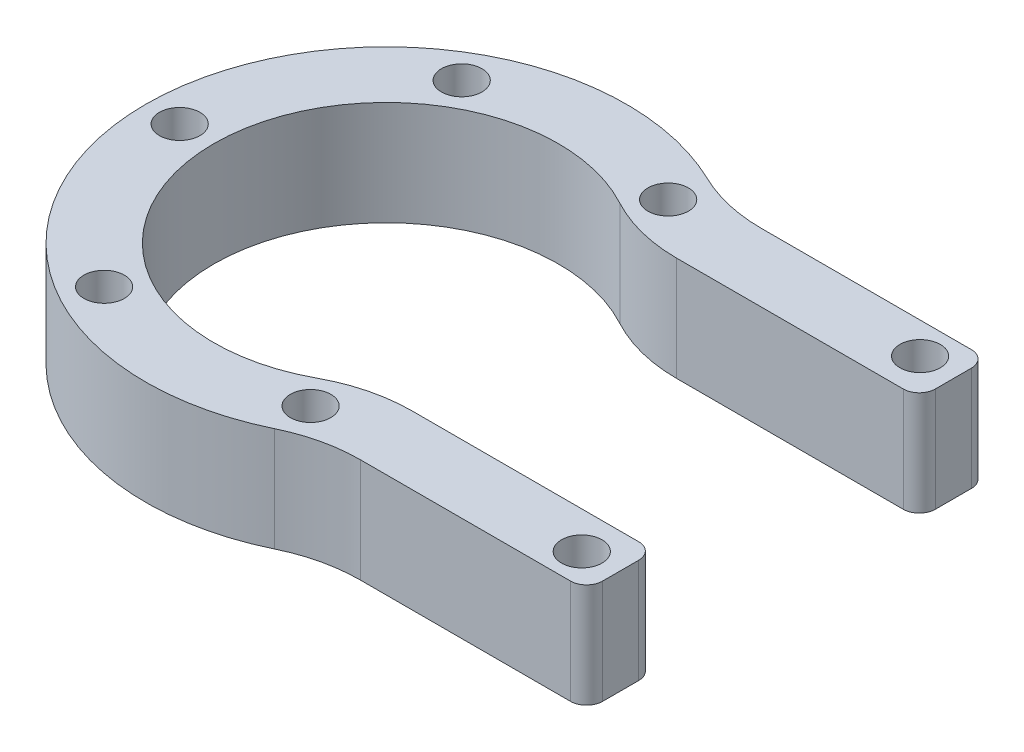
ISO-10303-21;
HEADER;
FILE_DESCRIPTION(('STEP AP214'),'2;1');
FILE_NAME('part.step','',(''),(''),'','','');
FILE_SCHEMA(('AUTOMOTIVE_DESIGN { 1 0 10303 214 1 1 1 1 }'));
ENDSEC;
DATA;
#1=APPLICATION_CONTEXT('core data for automotive mechanical design processes');
#2=APPLICATION_PROTOCOL_DEFINITION('international standard','automotive_design',2000,#1);
#3=PRODUCT_CONTEXT('',#1,'mechanical');
#4=PRODUCT('Part','Part','',(#3));
#5=PRODUCT_RELATED_PRODUCT_CATEGORY('part','',(#4));
#6=PRODUCT_DEFINITION_FORMATION('','',#4);
#7=PRODUCT_DEFINITION_CONTEXT('part definition',#1,'design');
#8=PRODUCT_DEFINITION('design','',#6,#7);
#9=PRODUCT_DEFINITION_SHAPE('','',#8);
#10=(LENGTH_UNIT() NAMED_UNIT(*) SI_UNIT(.MILLI.,.METRE.));
#11=(NAMED_UNIT(*) PLANE_ANGLE_UNIT() SI_UNIT($,.RADIAN.));
#12=(NAMED_UNIT(*) SI_UNIT($,.STERADIAN.) SOLID_ANGLE_UNIT());
#13=UNCERTAINTY_MEASURE_WITH_UNIT(LENGTH_MEASURE(1.E-05),#10,'distance_accuracy_value','');
#14=(GEOMETRIC_REPRESENTATION_CONTEXT(3) GLOBAL_UNCERTAINTY_ASSIGNED_CONTEXT((#13)) GLOBAL_UNIT_ASSIGNED_CONTEXT((#10,
#11,#12)) REPRESENTATION_CONTEXT('',''));
#15=CARTESIAN_POINT('',(0.,0.,0.));
#16=DIRECTION('',(0.,0.,1.));
#17=DIRECTION('',(1.,0.,0.));
#18=AXIS2_PLACEMENT_3D('',#15,#16,#17);
#19=CARTESIAN_POINT('',(0.,13.,0.));
#20=DIRECTION('',(0.,1.,0.));
#21=DIRECTION('',(0.,0.,1.));
#22=AXIS2_PLACEMENT_3D('',#19,#20,#21);
#23=PLANE('',#22);
#24=DIRECTION('',(1.,0.,0.));
#25=VECTOR('',#24,1.);
#26=CARTESIAN_POINT('',(0.,13.,-16.5));
#27=LINE('',#26,#25);
#28=CARTESIAN_POINT('',(19.7484176581315,13.,-16.5));
#29=VERTEX_POINT('',#28);
#30=CARTESIAN_POINT('',(48.,13.,-16.5));
#31=VERTEX_POINT('',#30);
#32=EDGE_CURVE('E265',#29,#31,#27,.T.);
#33=ORIENTED_EDGE('',*,*,#32,.T.);
#34=CARTESIAN_POINT('',(48.,13.,-18.5));
#35=DIRECTION('',(0.,1.,0.));
#36=DIRECTION('',(0.,0.,1.));
#37=AXIS2_PLACEMENT_3D('',#34,#35,#36);
#38=CIRCLE('',#37,2.);
#39=CARTESIAN_POINT('',(50.,13.,-18.5));
#40=VERTEX_POINT('',#39);
#41=EDGE_CURVE('E241',#31,#40,#38,.T.);
#42=ORIENTED_EDGE('',*,*,#41,.T.);
#43=DIRECTION('',(0.,0.,1.));
#44=VECTOR('',#43,1.);
#45=CARTESIAN_POINT('',(50.,13.,-25.));
#46=LINE('',#45,#44);
#47=CARTESIAN_POINT('',(50.,13.,-23.));
#48=VERTEX_POINT('',#47);
#49=EDGE_CURVE('E257',#48,#40,#46,.T.);
#50=ORIENTED_EDGE('',*,*,#49,.F.);
#51=CARTESIAN_POINT('',(48.,13.,-23.));
#52=DIRECTION('',(0.,1.,0.));
#53=DIRECTION('',(0.,0.,1.));
#54=AXIS2_PLACEMENT_3D('',#51,#52,#53);
#55=CIRCLE('',#54,2.);
#56=CARTESIAN_POINT('',(48.,13.,-25.));
#57=VERTEX_POINT('',#56);
#58=EDGE_CURVE('E239',#48,#57,#55,.T.);
#59=ORIENTED_EDGE('',*,*,#58,.T.);
#60=DIRECTION('',(1.,0.,0.));
#61=VECTOR('',#60,1.);
#62=CARTESIAN_POINT('',(0.,13.,-25.));
#63=LINE('',#62,#61);
#64=CARTESIAN_POINT('',(21.7944947177034,13.,-25.));
#65=VERTEX_POINT('',#64);
#66=EDGE_CURVE('E185',#65,#57,#63,.T.);
#67=ORIENTED_EDGE('',*,*,#66,.F.);
#68=CARTESIAN_POINT('',(21.7944947177034,13.,-45.));
#69=DIRECTION('',(0.,1.,0.));
#70=DIRECTION('',(0.,0.,1.));
#71=AXIS2_PLACEMENT_3D('',#68,#69,#70);
#72=CIRCLE('',#71,20.);
#73=CARTESIAN_POINT('',(13.076696830622,13.,-27.));
#74=VERTEX_POINT('',#73);
#75=EDGE_CURVE('E215',#65,#74,#72,.F.);
#76=ORIENTED_EDGE('',*,*,#75,.T.);
#77=CARTESIAN_POINT('',(0.,13.,0.));
#78=DIRECTION('',(0.,1.,0.));
#79=DIRECTION('',(0.,0.,1.));
#80=AXIS2_PLACEMENT_3D('',#77,#78,#79);
#81=CIRCLE('',#80,30.);
#82=CARTESIAN_POINT('',(13.076696830622,13.,27.));
#83=VERTEX_POINT('',#82);
#84=EDGE_CURVE('E316',#74,#83,#81,.T.);
#85=ORIENTED_EDGE('',*,*,#84,.T.);
#86=CARTESIAN_POINT('',(21.7944947177034,13.,45.));
#87=DIRECTION('',(0.,1.,0.));
#88=DIRECTION('',(0.,0.,1.));
#89=AXIS2_PLACEMENT_3D('',#86,#87,#88);
#90=CIRCLE('',#89,20.);
#91=CARTESIAN_POINT('',(21.7944947177034,13.,25.));
#92=VERTEX_POINT('',#91);
#93=EDGE_CURVE('E219',#83,#92,#90,.F.);
#94=ORIENTED_EDGE('',*,*,#93,.T.);
#95=DIRECTION('',(1.,0.,0.));
#96=VECTOR('',#95,1.);
#97=CARTESIAN_POINT('',(0.,13.,25.));
#98=LINE('',#97,#96);
#99=CARTESIAN_POINT('',(48.,13.,25.));
#100=VERTEX_POINT('',#99);
#101=EDGE_CURVE('E189',#92,#100,#98,.T.);
#102=ORIENTED_EDGE('',*,*,#101,.T.);
#103=CARTESIAN_POINT('',(48.,13.,23.));
#104=DIRECTION('',(0.,1.,0.));
#105=DIRECTION('',(0.,0.,1.));
#106=AXIS2_PLACEMENT_3D('',#103,#104,#105);
#107=CIRCLE('',#106,2.);
#108=CARTESIAN_POINT('',(50.,13.,23.));
#109=VERTEX_POINT('',#108);
#110=EDGE_CURVE('E59',#100,#109,#107,.T.);
#111=ORIENTED_EDGE('',*,*,#110,.T.);
#112=CARTESIAN_POINT('',(50.,13.,18.5));
#113=VERTEX_POINT('',#112);
#114=EDGE_CURVE('E251',#113,#109,#46,.T.);
#115=ORIENTED_EDGE('',*,*,#114,.F.);
#116=CARTESIAN_POINT('',(48.,13.,18.5));
#117=DIRECTION('',(0.,1.,0.));
#118=DIRECTION('',(0.,0.,1.));
#119=AXIS2_PLACEMENT_3D('',#116,#117,#118);
#120=CIRCLE('',#119,2.);
#121=CARTESIAN_POINT('',(48.,13.,16.5));
#122=VERTEX_POINT('',#121);
#123=EDGE_CURVE('E67',#113,#122,#120,.T.);
#124=ORIENTED_EDGE('',*,*,#123,.T.);
#125=DIRECTION('',(-1.,0.,0.));
#126=VECTOR('',#125,1.);
#127=CARTESIAN_POINT('',(0.,13.,16.5));
#128=LINE('',#127,#126);
#129=CARTESIAN_POINT('',(19.7484176581315,13.,16.5));
#130=VERTEX_POINT('',#129);
#131=EDGE_CURVE('E279',#122,#130,#128,.T.);
#132=ORIENTED_EDGE('',*,*,#131,.T.);
#133=CARTESIAN_POINT('',(19.7484176581315,13.,36.5));
#134=DIRECTION('',(0.,1.,0.));
#135=DIRECTION('',(0.,0.,1.));
#136=AXIS2_PLACEMENT_3D('',#133,#134,#135);
#137=CIRCLE('',#136,20.);
#138=CARTESIAN_POINT('',(10.2311079433693,13.,18.9096385542169));
#139=VERTEX_POINT('',#138);
#140=EDGE_CURVE('E183',#130,#139,#137,.T.);
#141=ORIENTED_EDGE('',*,*,#140,.T.);
#142=CARTESIAN_POINT('',(0.,13.,0.));
#143=DIRECTION('',(0.,1.,0.));
#144=DIRECTION('',(0.,0.,1.));
#145=AXIS2_PLACEMENT_3D('',#142,#143,#144);
#146=CIRCLE('',#145,21.5);
#147=CARTESIAN_POINT('',(10.2311079433693,13.,-18.9096385542169));
#148=VERTEX_POINT('',#147);
#149=EDGE_CURVE('E282',#148,#139,#146,.T.);
#150=ORIENTED_EDGE('',*,*,#149,.F.);
#151=CARTESIAN_POINT('',(19.7484176581315,13.,-36.5));
#152=DIRECTION('',(0.,1.,0.));
#153=DIRECTION('',(0.,0.,1.));
#154=AXIS2_PLACEMENT_3D('',#151,#152,#153);
#155=CIRCLE('',#154,20.);
#156=EDGE_CURVE('E184',#148,#29,#155,.T.);
#157=ORIENTED_EDGE('',*,*,#156,.T.);
#158=EDGE_LOOP('',(#33,#42,#50,#59,#67,#76,#85,#94,#102,#111,#115,#124,#132,#141,#150,#157));
#159=FACE_BOUND('',#158,.T.);
#160=CARTESIAN_POINT('',(45.5,13.,-21.1));
#161=DIRECTION('',(0.,1.,0.));
#162=DIRECTION('',(0.,0.,1.));
#163=AXIS2_PLACEMENT_3D('',#160,#161,#162);
#164=CIRCLE('',#163,2.525);
#165=CARTESIAN_POINT('',(45.5,13.,-18.575));
#166=VERTEX_POINT('',#165);
#167=EDGE_CURVE('E266',#166,#166,#164,.T.);
#168=ORIENTED_EDGE('',*,*,#167,.F.);
#169=EDGE_LOOP('',(#168));
#170=FACE_BOUND('',#169,.T.);
#171=CARTESIAN_POINT('',(45.5,13.,21.1));
#172=DIRECTION('',(0.,1.,0.));
#173=DIRECTION('',(0.,0.,-1.));
#174=AXIS2_PLACEMENT_3D('',#171,#172,#173);
#175=CIRCLE('',#174,2.525);
#176=CARTESIAN_POINT('',(45.5,13.,18.575));
#177=VERTEX_POINT('',#176);
#178=EDGE_CURVE('E269',#177,#177,#175,.T.);
#179=ORIENTED_EDGE('',*,*,#178,.F.);
#180=EDGE_LOOP('',(#179));
#181=FACE_BOUND('',#180,.T.);
#182=CARTESIAN_POINT('',(-12.875,13.,-22.3001541474493));
#183=DIRECTION('',(0.,1.,0.));
#184=DIRECTION('',(0.,0.,1.));
#185=AXIS2_PLACEMENT_3D('',#182,#183,#184);
#186=CIRCLE('',#185,2.52500000000038);
#187=CARTESIAN_POINT('',(-12.875,13.,-19.7751541474489));
#188=VERTEX_POINT('',#187);
#189=EDGE_CURVE('E293',#188,#188,#186,.T.);
#190=ORIENTED_EDGE('',*,*,#189,.F.);
#191=EDGE_LOOP('',(#190));
#192=FACE_BOUND('',#191,.T.);
#193=CARTESIAN_POINT('',(12.8750000000004,13.,-22.3001541474491));
#194=DIRECTION('',(0.,1.,0.));
#195=DIRECTION('',(0.,0.,1.));
#196=AXIS2_PLACEMENT_3D('',#193,#194,#195);
#197=CIRCLE('',#196,2.525);
#198=CARTESIAN_POINT('',(12.8750000000004,13.,-19.7751541474491));
#199=VERTEX_POINT('',#198);
#200=EDGE_CURVE('E305',#199,#199,#197,.T.);
#201=ORIENTED_EDGE('',*,*,#200,.F.);
#202=EDGE_LOOP('',(#201));
#203=FACE_BOUND('',#202,.T.);
#204=CARTESIAN_POINT('',(12.8749999999995,13.,22.3001541474496));
#205=DIRECTION('',(0.,1.,0.));
#206=DIRECTION('',(0.,0.,1.));
#207=AXIS2_PLACEMENT_3D('',#204,#205,#206);
#208=CIRCLE('',#207,2.525);
#209=CARTESIAN_POINT('',(12.8749999999995,13.,24.8251541474496));
#210=VERTEX_POINT('',#209);
#211=EDGE_CURVE('E311',#210,#210,#208,.T.);
#212=ORIENTED_EDGE('',*,*,#211,.F.);
#213=EDGE_LOOP('',(#212));
#214=FACE_BOUND('',#213,.T.);
#215=CARTESIAN_POINT('',(-12.8750000000003,13.,22.3001541474492));
#216=DIRECTION('',(0.,1.,0.));
#217=DIRECTION('',(0.,0.,1.));
#218=AXIS2_PLACEMENT_3D('',#215,#216,#217);
#219=CIRCLE('',#218,2.525);
#220=CARTESIAN_POINT('',(-12.8750000000003,13.,24.8251541474492));
#221=VERTEX_POINT('',#220);
#222=EDGE_CURVE('E294',#221,#221,#219,.T.);
#223=ORIENTED_EDGE('',*,*,#222,.F.);
#224=EDGE_LOOP('',(#223));
#225=FACE_BOUND('',#224,.T.);
#226=CARTESIAN_POINT('',(-25.75,13.,0.));
#227=DIRECTION('',(0.,1.,0.));
#228=DIRECTION('',(0.,0.,1.));
#229=AXIS2_PLACEMENT_3D('',#226,#227,#228);
#230=CIRCLE('',#229,2.525);
#231=CARTESIAN_POINT('',(-25.75,13.,2.525));
#232=VERTEX_POINT('',#231);
#233=EDGE_CURVE('E290',#232,#232,#230,.T.);
#234=ORIENTED_EDGE('',*,*,#233,.F.);
#235=EDGE_LOOP('',(#234));
#236=FACE_BOUND('',#235,.T.);
#237=ADVANCED_FACE('F44',(#159,#170,#181,#192,#203,#214,#225,#236),#23,.T.);
#238=CARTESIAN_POINT('',(0.,0.,0.));
#239=DIRECTION('',(0.,1.,0.));
#240=DIRECTION('',(0.,0.,1.));
#241=AXIS2_PLACEMENT_3D('',#238,#239,#240);
#242=PLANE('',#241);
#243=CARTESIAN_POINT('',(45.5,0.,-21.1));
#244=DIRECTION('',(0.,1.,0.));
#245=DIRECTION('',(0.,0.,1.));
#246=AXIS2_PLACEMENT_3D('',#243,#244,#245);
#247=CIRCLE('',#246,2.525);
#248=CARTESIAN_POINT('',(45.5,0.,-18.575));
#249=VERTEX_POINT('',#248);
#250=EDGE_CURVE('E262',#249,#249,#247,.T.);
#251=ORIENTED_EDGE('',*,*,#250,.T.);
#252=EDGE_LOOP('',(#251));
#253=FACE_BOUND('',#252,.T.);
#254=CARTESIAN_POINT('',(45.5,0.,21.1));
#255=DIRECTION('',(0.,1.,0.));
#256=DIRECTION('',(0.,0.,-1.));
#257=AXIS2_PLACEMENT_3D('',#254,#255,#256);
#258=CIRCLE('',#257,2.525);
#259=CARTESIAN_POINT('',(45.5,0.,18.575));
#260=VERTEX_POINT('',#259);
#261=EDGE_CURVE('E272',#260,#260,#258,.T.);
#262=ORIENTED_EDGE('',*,*,#261,.T.);
#263=EDGE_LOOP('',(#262));
#264=FACE_BOUND('',#263,.T.);
#265=CARTESIAN_POINT('',(-12.875,0.,-22.3001541474493));
#266=DIRECTION('',(0.,1.,0.));
#267=DIRECTION('',(0.,0.,1.));
#268=AXIS2_PLACEMENT_3D('',#265,#266,#267);
#269=CIRCLE('',#268,2.52500000000038);
#270=CARTESIAN_POINT('',(-12.875,0.,-19.7751541474489));
#271=VERTEX_POINT('',#270);
#272=EDGE_CURVE('E302',#271,#271,#269,.T.);
#273=ORIENTED_EDGE('',*,*,#272,.T.);
#274=EDGE_LOOP('',(#273));
#275=FACE_BOUND('',#274,.T.);
#276=CARTESIAN_POINT('',(12.8750000000004,0.,-22.3001541474491));
#277=DIRECTION('',(0.,1.,0.));
#278=DIRECTION('',(0.,0.,1.));
#279=AXIS2_PLACEMENT_3D('',#276,#277,#278);
#280=CIRCLE('',#279,2.525);
#281=CARTESIAN_POINT('',(12.8750000000004,0.,-19.7751541474491));
#282=VERTEX_POINT('',#281);
#283=EDGE_CURVE('E308',#282,#282,#280,.T.);
#284=ORIENTED_EDGE('',*,*,#283,.T.);
#285=EDGE_LOOP('',(#284));
#286=FACE_BOUND('',#285,.T.);
#287=CARTESIAN_POINT('',(12.8749999999995,0.,22.3001541474496));
#288=DIRECTION('',(0.,1.,0.));
#289=DIRECTION('',(0.,0.,1.));
#290=AXIS2_PLACEMENT_3D('',#287,#288,#289);
#291=CIRCLE('',#290,2.525);
#292=CARTESIAN_POINT('',(12.8749999999995,0.,24.8251541474496));
#293=VERTEX_POINT('',#292);
#294=EDGE_CURVE('E297',#293,#293,#291,.T.);
#295=ORIENTED_EDGE('',*,*,#294,.T.);
#296=EDGE_LOOP('',(#295));
#297=FACE_BOUND('',#296,.T.);
#298=CARTESIAN_POINT('',(-12.8750000000003,0.,22.3001541474492));
#299=DIRECTION('',(0.,1.,0.));
#300=DIRECTION('',(0.,0.,1.));
#301=AXIS2_PLACEMENT_3D('',#298,#299,#300);
#302=CIRCLE('',#301,2.525);
#303=CARTESIAN_POINT('',(-12.8750000000003,0.,24.8251541474492));
#304=VERTEX_POINT('',#303);
#305=EDGE_CURVE('E167',#304,#304,#302,.T.);
#306=ORIENTED_EDGE('',*,*,#305,.T.);
#307=EDGE_LOOP('',(#306));
#308=FACE_BOUND('',#307,.T.);
#309=CARTESIAN_POINT('',(-25.75,0.,0.));
#310=DIRECTION('',(0.,1.,0.));
#311=DIRECTION('',(0.,0.,1.));
#312=AXIS2_PLACEMENT_3D('',#309,#310,#311);
#313=CIRCLE('',#312,2.525);
#314=CARTESIAN_POINT('',(-25.75,0.,2.525));
#315=VERTEX_POINT('',#314);
#316=EDGE_CURVE('E286',#315,#315,#313,.T.);
#317=ORIENTED_EDGE('',*,*,#316,.T.);
#318=EDGE_LOOP('',(#317));
#319=FACE_BOUND('',#318,.T.);
#320=DIRECTION('',(0.,0.,1.));
#321=VECTOR('',#320,1.);
#322=CARTESIAN_POINT('',(50.,0.,-25.));
#323=LINE('',#322,#321);
#324=CARTESIAN_POINT('',(50.,0.,-23.));
#325=VERTEX_POINT('',#324);
#326=CARTESIAN_POINT('',(50.,0.,-18.5));
#327=VERTEX_POINT('',#326);
#328=EDGE_CURVE('E275',#325,#327,#323,.T.);
#329=ORIENTED_EDGE('',*,*,#328,.T.);
#330=CARTESIAN_POINT('',(48.,0.,-18.5));
#331=DIRECTION('',(0.,1.,0.));
#332=DIRECTION('',(0.,0.,1.));
#333=AXIS2_PLACEMENT_3D('',#330,#331,#332);
#334=CIRCLE('',#333,2.);
#335=CARTESIAN_POINT('',(48.,0.,-16.5));
#336=VERTEX_POINT('',#335);
#337=EDGE_CURVE('E233',#327,#336,#334,.F.);
#338=ORIENTED_EDGE('',*,*,#337,.T.);
#339=DIRECTION('',(1.,0.,0.));
#340=VECTOR('',#339,1.);
#341=CARTESIAN_POINT('',(0.,0.,-16.5));
#342=LINE('',#341,#340);
#343=CARTESIAN_POINT('',(19.7484176581315,0.,-16.5));
#344=VERTEX_POINT('',#343);
#345=EDGE_CURVE('E276',#344,#336,#342,.T.);
#346=ORIENTED_EDGE('',*,*,#345,.F.);
#347=CARTESIAN_POINT('',(19.7484176581315,0.,-36.5));
#348=DIRECTION('',(0.,1.,0.));
#349=DIRECTION('',(0.,0.,1.));
#350=AXIS2_PLACEMENT_3D('',#347,#348,#349);
#351=CIRCLE('',#350,20.);
#352=CARTESIAN_POINT('',(10.2311079433693,0.,-18.9096385542169));
#353=VERTEX_POINT('',#352);
#354=EDGE_CURVE('E179',#344,#353,#351,.F.);
#355=ORIENTED_EDGE('',*,*,#354,.T.);
#356=CARTESIAN_POINT('',(0.,0.,0.));
#357=DIRECTION('',(0.,1.,0.));
#358=DIRECTION('',(0.,0.,1.));
#359=AXIS2_PLACEMENT_3D('',#356,#357,#358);
#360=CIRCLE('',#359,21.5);
#361=CARTESIAN_POINT('',(10.2311079433693,0.,18.9096385542169));
#362=VERTEX_POINT('',#361);
#363=EDGE_CURVE('E168',#353,#362,#360,.T.);
#364=ORIENTED_EDGE('',*,*,#363,.T.);
#365=CARTESIAN_POINT('',(19.7484176581315,0.,36.5));
#366=DIRECTION('',(0.,1.,0.));
#367=DIRECTION('',(0.,0.,1.));
#368=AXIS2_PLACEMENT_3D('',#365,#366,#367);
#369=CIRCLE('',#368,20.);
#370=CARTESIAN_POINT('',(19.7484176581315,0.,16.5));
#371=VERTEX_POINT('',#370);
#372=EDGE_CURVE('E172',#362,#371,#369,.F.);
#373=ORIENTED_EDGE('',*,*,#372,.T.);
#374=DIRECTION('',(-1.,0.,0.));
#375=VECTOR('',#374,1.);
#376=CARTESIAN_POINT('',(0.,0.,16.5));
#377=LINE('',#376,#375);
#378=CARTESIAN_POINT('',(48.,0.,16.5));
#379=VERTEX_POINT('',#378);
#380=EDGE_CURVE('E159',#379,#371,#377,.T.);
#381=ORIENTED_EDGE('',*,*,#380,.F.);
#382=CARTESIAN_POINT('',(48.,0.,18.5));
#383=DIRECTION('',(0.,1.,0.));
#384=DIRECTION('',(0.,0.,1.));
#385=AXIS2_PLACEMENT_3D('',#382,#383,#384);
#386=CIRCLE('',#385,2.);
#387=CARTESIAN_POINT('',(50.,0.,18.5));
#388=VERTEX_POINT('',#387);
#389=EDGE_CURVE('E229',#379,#388,#386,.F.);
#390=ORIENTED_EDGE('',*,*,#389,.T.);
#391=CARTESIAN_POINT('',(50.,0.,23.));
#392=VERTEX_POINT('',#391);
#393=EDGE_CURVE('E254',#388,#392,#323,.T.);
#394=ORIENTED_EDGE('',*,*,#393,.T.);
#395=CARTESIAN_POINT('',(48.,0.,23.));
#396=DIRECTION('',(0.,1.,0.));
#397=DIRECTION('',(0.,0.,1.));
#398=AXIS2_PLACEMENT_3D('',#395,#396,#397);
#399=CIRCLE('',#398,2.);
#400=CARTESIAN_POINT('',(48.,0.,25.));
#401=VERTEX_POINT('',#400);
#402=EDGE_CURVE('E227',#392,#401,#399,.F.);
#403=ORIENTED_EDGE('',*,*,#402,.T.);
#404=DIRECTION('',(1.,0.,0.));
#405=VECTOR('',#404,1.);
#406=CARTESIAN_POINT('',(0.,0.,25.));
#407=LINE('',#406,#405);
#408=CARTESIAN_POINT('',(21.7944947177034,0.,25.));
#409=VERTEX_POINT('',#408);
#410=EDGE_CURVE('E321',#409,#401,#407,.T.);
#411=ORIENTED_EDGE('',*,*,#410,.F.);
#412=CARTESIAN_POINT('',(21.7944947177034,0.,45.));
#413=DIRECTION('',(0.,1.,0.));
#414=DIRECTION('',(0.,0.,1.));
#415=AXIS2_PLACEMENT_3D('',#412,#413,#414);
#416=CIRCLE('',#415,20.);
#417=CARTESIAN_POINT('',(13.076696830622,0.,27.));
#418=VERTEX_POINT('',#417);
#419=EDGE_CURVE('E217',#409,#418,#416,.T.);
#420=ORIENTED_EDGE('',*,*,#419,.T.);
#421=CARTESIAN_POINT('',(0.,0.,0.));
#422=DIRECTION('',(0.,1.,0.));
#423=DIRECTION('',(0.,0.,1.));
#424=AXIS2_PLACEMENT_3D('',#421,#422,#423);
#425=CIRCLE('',#424,30.);
#426=CARTESIAN_POINT('',(13.076696830622,0.,-27.));
#427=VERTEX_POINT('',#426);
#428=EDGE_CURVE('E289',#427,#418,#425,.T.);
#429=ORIENTED_EDGE('',*,*,#428,.F.);
#430=CARTESIAN_POINT('',(21.7944947177034,0.,-45.));
#431=DIRECTION('',(0.,1.,0.));
#432=DIRECTION('',(0.,0.,1.));
#433=AXIS2_PLACEMENT_3D('',#430,#431,#432);
#434=CIRCLE('',#433,20.);
#435=CARTESIAN_POINT('',(21.7944947177034,0.,-25.));
#436=VERTEX_POINT('',#435);
#437=EDGE_CURVE('E213',#427,#436,#434,.T.);
#438=ORIENTED_EDGE('',*,*,#437,.T.);
#439=DIRECTION('',(1.,0.,0.));
#440=VECTOR('',#439,1.);
#441=CARTESIAN_POINT('',(0.,0.,-25.));
#442=LINE('',#441,#440);
#443=CARTESIAN_POINT('',(48.,0.,-25.));
#444=VERTEX_POINT('',#443);
#445=EDGE_CURVE('E192',#436,#444,#442,.T.);
#446=ORIENTED_EDGE('',*,*,#445,.T.);
#447=CARTESIAN_POINT('',(48.,0.,-23.));
#448=DIRECTION('',(0.,1.,0.));
#449=DIRECTION('',(0.,0.,1.));
#450=AXIS2_PLACEMENT_3D('',#447,#448,#449);
#451=CIRCLE('',#450,2.);
#452=EDGE_CURVE('E231',#444,#325,#451,.F.);
#453=ORIENTED_EDGE('',*,*,#452,.T.);
#454=EDGE_LOOP('',(#329,#338,#346,#355,#364,#373,#381,#390,#394,#403,#411,#420,#429,#438,#446,#453));
#455=FACE_BOUND('',#454,.T.);
#456=ADVANCED_FACE('F174',(#253,#264,#275,#286,#297,#308,#319,#455),#242,.F.);
#457=CARTESIAN_POINT('',(0.,13.,0.));
#458=DIRECTION('',(0.,-1.,0.));
#459=DIRECTION('',(0.,0.,-1.));
#460=AXIS2_PLACEMENT_3D('',#457,#458,#459);
#461=CYLINDRICAL_SURFACE('',#460,30.);
#462=ORIENTED_EDGE('',*,*,#84,.F.);
#463=DIRECTION('',(0.,-1.,0.));
#464=VECTOR('',#463,1.);
#465=CARTESIAN_POINT('',(13.076696830622,13.,-27.));
#466=LINE('',#465,#464);
#467=EDGE_CURVE('E205',#74,#427,#466,.T.);
#468=ORIENTED_EDGE('',*,*,#467,.T.);
#469=ORIENTED_EDGE('',*,*,#428,.T.);
#470=DIRECTION('',(0.,-1.,0.));
#471=VECTOR('',#470,1.);
#472=CARTESIAN_POINT('',(13.076696830622,13.,27.));
#473=LINE('',#472,#471);
#474=EDGE_CURVE('E203',#418,#83,#473,.F.);
#475=ORIENTED_EDGE('',*,*,#474,.T.);
#476=EDGE_LOOP('',(#462,#468,#469,#475));
#477=FACE_BOUND('',#476,.T.);
#478=ADVANCED_FACE('F359',(#477),#461,.T.);
#479=CARTESIAN_POINT('',(0.,13.,25.));
#480=DIRECTION('',(0.,0.,-1.));
#481=DIRECTION('',(-1.,0.,0.));
#482=AXIS2_PLACEMENT_3D('',#479,#480,#481);
#483=PLANE('',#482);
#484=ORIENTED_EDGE('',*,*,#410,.T.);
#485=DIRECTION('',(0.,1.,0.));
#486=VECTOR('',#485,1.);
#487=CARTESIAN_POINT('',(48.,13.,25.));
#488=LINE('',#487,#486);
#489=EDGE_CURVE('E11',#401,#100,#488,.T.);
#490=ORIENTED_EDGE('',*,*,#489,.T.);
#491=ORIENTED_EDGE('',*,*,#101,.F.);
#492=DIRECTION('',(0.,1.,0.));
#493=VECTOR('',#492,1.);
#494=CARTESIAN_POINT('',(21.7944947177034,0.,25.));
#495=LINE('',#494,#493);
#496=EDGE_CURVE('E210',#92,#409,#495,.F.);
#497=ORIENTED_EDGE('',*,*,#496,.T.);
#498=EDGE_LOOP('',(#484,#490,#491,#497));
#499=FACE_BOUND('',#498,.T.);
#500=ADVANCED_FACE('F351',(#499),#483,.F.);
#501=CARTESIAN_POINT('',(0.,13.,-25.));
#502=DIRECTION('',(0.,0.,-1.));
#503=DIRECTION('',(-1.,0.,0.));
#504=AXIS2_PLACEMENT_3D('',#501,#502,#503);
#505=PLANE('',#504);
#506=ORIENTED_EDGE('',*,*,#66,.T.);
#507=DIRECTION('',(0.,1.,0.));
#508=VECTOR('',#507,1.);
#509=CARTESIAN_POINT('',(48.,0.,-25.));
#510=LINE('',#509,#508);
#511=EDGE_CURVE('E243',#57,#444,#510,.F.);
#512=ORIENTED_EDGE('',*,*,#511,.T.);
#513=ORIENTED_EDGE('',*,*,#445,.F.);
#514=DIRECTION('',(0.,-1.,0.));
#515=VECTOR('',#514,1.);
#516=CARTESIAN_POINT('',(21.7944947177034,13.,-25.));
#517=LINE('',#516,#515);
#518=EDGE_CURVE('E208',#436,#65,#517,.F.);
#519=ORIENTED_EDGE('',*,*,#518,.T.);
#520=EDGE_LOOP('',(#506,#512,#513,#519));
#521=FACE_BOUND('',#520,.T.);
#522=ADVANCED_FACE('F364',(#521),#505,.T.);
#523=CARTESIAN_POINT('',(-12.875,0.,-22.3001541474493));
#524=DIRECTION('',(0.,1.,0.));
#525=DIRECTION('',(0.,0.,1.));
#526=AXIS2_PLACEMENT_3D('',#523,#524,#525);
#527=CYLINDRICAL_SURFACE('',#526,2.52500000000038);
#528=ORIENTED_EDGE('',*,*,#272,.F.);
#529=EDGE_LOOP('',(#528));
#530=FACE_BOUND('',#529,.T.);
#531=ORIENTED_EDGE('',*,*,#189,.T.);
#532=EDGE_LOOP('',(#531));
#533=FACE_BOUND('',#532,.T.);
#534=ADVANCED_FACE('F366',(#530,#533),#527,.F.);
#535=CARTESIAN_POINT('',(12.8750000000004,0.,-22.3001541474491));
#536=DIRECTION('',(0.,1.,0.));
#537=DIRECTION('',(0.,0.,1.));
#538=AXIS2_PLACEMENT_3D('',#535,#536,#537);
#539=CYLINDRICAL_SURFACE('',#538,2.525);
#540=ORIENTED_EDGE('',*,*,#283,.F.);
#541=EDGE_LOOP('',(#540));
#542=FACE_BOUND('',#541,.T.);
#543=ORIENTED_EDGE('',*,*,#200,.T.);
#544=EDGE_LOOP('',(#543));
#545=FACE_BOUND('',#544,.T.);
#546=ADVANCED_FACE('F373',(#542,#545),#539,.F.);
#547=CARTESIAN_POINT('',(12.8749999999995,0.,22.3001541474496));
#548=DIRECTION('',(0.,1.,0.));
#549=DIRECTION('',(0.,0.,1.));
#550=AXIS2_PLACEMENT_3D('',#547,#548,#549);
#551=CYLINDRICAL_SURFACE('',#550,2.525);
#552=ORIENTED_EDGE('',*,*,#294,.F.);
#553=EDGE_LOOP('',(#552));
#554=FACE_BOUND('',#553,.T.);
#555=ORIENTED_EDGE('',*,*,#211,.T.);
#556=EDGE_LOOP('',(#555));
#557=FACE_BOUND('',#556,.T.);
#558=ADVANCED_FACE('F386',(#554,#557),#551,.F.);
#559=CARTESIAN_POINT('',(-12.8750000000003,0.,22.3001541474492));
#560=DIRECTION('',(0.,1.,0.));
#561=DIRECTION('',(0.,0.,1.));
#562=AXIS2_PLACEMENT_3D('',#559,#560,#561);
#563=CYLINDRICAL_SURFACE('',#562,2.525);
#564=ORIENTED_EDGE('',*,*,#305,.F.);
#565=EDGE_LOOP('',(#564));
#566=FACE_BOUND('',#565,.T.);
#567=ORIENTED_EDGE('',*,*,#222,.T.);
#568=EDGE_LOOP('',(#567));
#569=FACE_BOUND('',#568,.T.);
#570=ADVANCED_FACE('F389',(#566,#569),#563,.F.);
#571=CARTESIAN_POINT('',(-25.75,0.,0.));
#572=DIRECTION('',(0.,1.,0.));
#573=DIRECTION('',(0.,0.,1.));
#574=AXIS2_PLACEMENT_3D('',#571,#572,#573);
#575=CYLINDRICAL_SURFACE('',#574,2.525);
#576=ORIENTED_EDGE('',*,*,#316,.F.);
#577=EDGE_LOOP('',(#576));
#578=FACE_BOUND('',#577,.T.);
#579=ORIENTED_EDGE('',*,*,#233,.T.);
#580=EDGE_LOOP('',(#579));
#581=FACE_BOUND('',#580,.T.);
#582=ADVANCED_FACE('F396',(#578,#581),#575,.F.);
#583=CARTESIAN_POINT('',(0.,0.,-16.5));
#584=DIRECTION('',(0.,0.,1.));
#585=DIRECTION('',(1.,0.,0.));
#586=AXIS2_PLACEMENT_3D('',#583,#584,#585);
#587=PLANE('',#586);
#588=ORIENTED_EDGE('',*,*,#345,.T.);
#589=DIRECTION('',(0.,-1.,0.));
#590=VECTOR('',#589,1.);
#591=CARTESIAN_POINT('',(48.,13.,-16.5));
#592=LINE('',#591,#590);
#593=EDGE_CURVE('E235',#336,#31,#592,.F.);
#594=ORIENTED_EDGE('',*,*,#593,.T.);
#595=ORIENTED_EDGE('',*,*,#32,.F.);
#596=DIRECTION('',(0.,-1.,0.));
#597=VECTOR('',#596,1.);
#598=CARTESIAN_POINT('',(19.7484176581315,0.,-16.5));
#599=LINE('',#598,#597);
#600=EDGE_CURVE('E178',#29,#344,#599,.T.);
#601=ORIENTED_EDGE('',*,*,#600,.T.);
#602=EDGE_LOOP('',(#588,#594,#595,#601));
#603=FACE_BOUND('',#602,.T.);
#604=ADVANCED_FACE('F400',(#603),#587,.T.);
#605=CARTESIAN_POINT('',(0.,0.,16.5));
#606=DIRECTION('',(0.,0.,-1.));
#607=DIRECTION('',(-1.,0.,0.));
#608=AXIS2_PLACEMENT_3D('',#605,#606,#607);
#609=PLANE('',#608);
#610=ORIENTED_EDGE('',*,*,#131,.F.);
#611=DIRECTION('',(0.,1.,0.));
#612=VECTOR('',#611,1.);
#613=CARTESIAN_POINT('',(48.,0.,16.5));
#614=LINE('',#613,#612);
#615=EDGE_CURVE('E52',#122,#379,#614,.F.);
#616=ORIENTED_EDGE('',*,*,#615,.T.);
#617=ORIENTED_EDGE('',*,*,#380,.T.);
#618=DIRECTION('',(0.,-1.,0.));
#619=VECTOR('',#618,1.);
#620=CARTESIAN_POINT('',(19.7484176581315,13.,16.5));
#621=LINE('',#620,#619);
#622=EDGE_CURVE('E164',#371,#130,#621,.F.);
#623=ORIENTED_EDGE('',*,*,#622,.T.);
#624=EDGE_LOOP('',(#610,#616,#617,#623));
#625=FACE_BOUND('',#624,.T.);
#626=ADVANCED_FACE('F162',(#625),#609,.T.);
#627=CARTESIAN_POINT('',(0.,0.,0.));
#628=DIRECTION('',(0.,1.,0.));
#629=DIRECTION('',(0.,0.,1.));
#630=AXIS2_PLACEMENT_3D('',#627,#628,#629);
#631=CYLINDRICAL_SURFACE('',#630,21.5);
#632=ORIENTED_EDGE('',*,*,#149,.T.);
#633=DIRECTION('',(0.,1.,0.));
#634=VECTOR('',#633,1.);
#635=CARTESIAN_POINT('',(10.2311079433693,0.,18.9096385542169));
#636=LINE('',#635,#634);
#637=EDGE_CURVE('E199',#139,#362,#636,.F.);
#638=ORIENTED_EDGE('',*,*,#637,.T.);
#639=ORIENTED_EDGE('',*,*,#363,.F.);
#640=DIRECTION('',(0.,1.,0.));
#641=VECTOR('',#640,1.);
#642=CARTESIAN_POINT('',(10.2311079433693,0.,-18.9096385542169));
#643=LINE('',#642,#641);
#644=EDGE_CURVE('E196',#353,#148,#643,.T.);
#645=ORIENTED_EDGE('',*,*,#644,.T.);
#646=EDGE_LOOP('',(#632,#638,#639,#645));
#647=FACE_BOUND('',#646,.T.);
#648=ADVANCED_FACE('F404',(#647),#631,.F.);
#649=CARTESIAN_POINT('',(45.5,0.,21.1));
#650=DIRECTION('',(0.,1.,0.));
#651=DIRECTION('',(0.,0.,1.));
#652=AXIS2_PLACEMENT_3D('',#649,#650,#651);
#653=CYLINDRICAL_SURFACE('',#652,2.525);
#654=ORIENTED_EDGE('',*,*,#261,.F.);
#655=EDGE_LOOP('',(#654));
#656=FACE_BOUND('',#655,.T.);
#657=ORIENTED_EDGE('',*,*,#178,.T.);
#658=EDGE_LOOP('',(#657));
#659=FACE_BOUND('',#658,.T.);
#660=ADVANCED_FACE('F407',(#656,#659),#653,.F.);
#661=CARTESIAN_POINT('',(45.5,0.,-21.1));
#662=DIRECTION('',(0.,1.,0.));
#663=DIRECTION('',(0.,0.,1.));
#664=AXIS2_PLACEMENT_3D('',#661,#662,#663);
#665=CYLINDRICAL_SURFACE('',#664,2.525);
#666=ORIENTED_EDGE('',*,*,#250,.F.);
#667=EDGE_LOOP('',(#666));
#668=FACE_BOUND('',#667,.T.);
#669=ORIENTED_EDGE('',*,*,#167,.T.);
#670=EDGE_LOOP('',(#669));
#671=FACE_BOUND('',#670,.T.);
#672=ADVANCED_FACE('F413',(#668,#671),#665,.F.);
#673=CARTESIAN_POINT('',(50.,0.,-25.));
#674=DIRECTION('',(-1.,0.,0.));
#675=DIRECTION('',(0.,0.,1.));
#676=AXIS2_PLACEMENT_3D('',#673,#674,#675);
#677=PLANE('',#676);
#678=ORIENTED_EDGE('',*,*,#393,.F.);
#679=DIRECTION('',(0.,1.,0.));
#680=VECTOR('',#679,1.);
#681=CARTESIAN_POINT('',(50.,13.,18.5));
#682=LINE('',#681,#680);
#683=EDGE_CURVE('E247',#388,#113,#682,.T.);
#684=ORIENTED_EDGE('',*,*,#683,.T.);
#685=ORIENTED_EDGE('',*,*,#114,.T.);
#686=DIRECTION('',(0.,1.,0.));
#687=VECTOR('',#686,1.);
#688=CARTESIAN_POINT('',(50.,0.,23.));
#689=LINE('',#688,#687);
#690=EDGE_CURVE('E245',#109,#392,#689,.F.);
#691=ORIENTED_EDGE('',*,*,#690,.T.);
#692=EDGE_LOOP('',(#678,#684,#685,#691));
#693=FACE_BOUND('',#692,.T.);
#694=ADVANCED_FACE('F250',(#693),#677,.F.);
#695=ORIENTED_EDGE('',*,*,#49,.T.);
#696=DIRECTION('',(0.,-1.,0.));
#697=VECTOR('',#696,1.);
#698=CARTESIAN_POINT('',(50.,0.,-18.5));
#699=LINE('',#698,#697);
#700=EDGE_CURVE('E224',#40,#327,#699,.T.);
#701=ORIENTED_EDGE('',*,*,#700,.T.);
#702=ORIENTED_EDGE('',*,*,#328,.F.);
#703=DIRECTION('',(0.,1.,0.));
#704=VECTOR('',#703,1.);
#705=CARTESIAN_POINT('',(50.,13.,-23.));
#706=LINE('',#705,#704);
#707=EDGE_CURVE('E221',#325,#48,#706,.T.);
#708=ORIENTED_EDGE('',*,*,#707,.T.);
#709=EDGE_LOOP('',(#695,#701,#702,#708));
#710=FACE_BOUND('',#709,.T.);
#711=ADVANCED_FACE('F339',(#710),#677,.F.);
#712=CARTESIAN_POINT('',(19.7484176581315,0.,36.5));
#713=DIRECTION('',(0.,1.,0.));
#714=DIRECTION('',(0.,0.,1.));
#715=AXIS2_PLACEMENT_3D('',#712,#713,#714);
#716=CYLINDRICAL_SURFACE('',#715,20.);
#717=ORIENTED_EDGE('',*,*,#372,.F.);
#718=ORIENTED_EDGE('',*,*,#637,.F.);
#719=ORIENTED_EDGE('',*,*,#140,.F.);
#720=ORIENTED_EDGE('',*,*,#622,.F.);
#721=EDGE_LOOP('',(#717,#718,#719,#720));
#722=FACE_BOUND('',#721,.T.);
#723=ADVANCED_FACE('F182',(#722),#716,.T.);
#724=CARTESIAN_POINT('',(19.7484176581315,0.,-36.5));
#725=DIRECTION('',(0.,1.,0.));
#726=DIRECTION('',(0.,0.,1.));
#727=AXIS2_PLACEMENT_3D('',#724,#725,#726);
#728=CYLINDRICAL_SURFACE('',#727,20.);
#729=ORIENTED_EDGE('',*,*,#354,.F.);
#730=ORIENTED_EDGE('',*,*,#600,.F.);
#731=ORIENTED_EDGE('',*,*,#156,.F.);
#732=ORIENTED_EDGE('',*,*,#644,.F.);
#733=EDGE_LOOP('',(#729,#730,#731,#732));
#734=FACE_BOUND('',#733,.T.);
#735=ADVANCED_FACE('F426',(#734),#728,.T.);
#736=CARTESIAN_POINT('',(21.7944947177034,13.,-45.));
#737=DIRECTION('',(0.,-1.,0.));
#738=DIRECTION('',(0.,0.,-1.));
#739=AXIS2_PLACEMENT_3D('',#736,#737,#738);
#740=CYLINDRICAL_SURFACE('',#739,20.);
#741=ORIENTED_EDGE('',*,*,#75,.F.);
#742=ORIENTED_EDGE('',*,*,#518,.F.);
#743=ORIENTED_EDGE('',*,*,#437,.F.);
#744=ORIENTED_EDGE('',*,*,#467,.F.);
#745=EDGE_LOOP('',(#741,#742,#743,#744));
#746=FACE_BOUND('',#745,.T.);
#747=ADVANCED_FACE('F363',(#746),#740,.F.);
#748=CARTESIAN_POINT('',(21.7944947177034,13.,45.));
#749=DIRECTION('',(0.,-1.,0.));
#750=DIRECTION('',(0.,0.,-1.));
#751=AXIS2_PLACEMENT_3D('',#748,#749,#750);
#752=CYLINDRICAL_SURFACE('',#751,20.);
#753=ORIENTED_EDGE('',*,*,#93,.F.);
#754=ORIENTED_EDGE('',*,*,#474,.F.);
#755=ORIENTED_EDGE('',*,*,#419,.F.);
#756=ORIENTED_EDGE('',*,*,#496,.F.);
#757=EDGE_LOOP('',(#753,#754,#755,#756));
#758=FACE_BOUND('',#757,.T.);
#759=ADVANCED_FACE('F357',(#758),#752,.F.);
#760=CARTESIAN_POINT('',(48.,0.,-18.5));
#761=DIRECTION('',(0.,1.,0.));
#762=DIRECTION('',(0.,0.,1.));
#763=AXIS2_PLACEMENT_3D('',#760,#761,#762);
#764=CYLINDRICAL_SURFACE('',#763,2.);
#765=ORIENTED_EDGE('',*,*,#41,.F.);
#766=ORIENTED_EDGE('',*,*,#593,.F.);
#767=ORIENTED_EDGE('',*,*,#337,.F.);
#768=ORIENTED_EDGE('',*,*,#700,.F.);
#769=EDGE_LOOP('',(#765,#766,#767,#768));
#770=FACE_BOUND('',#769,.T.);
#771=ADVANCED_FACE('F346',(#770),#764,.T.);
#772=CARTESIAN_POINT('',(48.,0.,-23.));
#773=DIRECTION('',(0.,-1.,0.));
#774=DIRECTION('',(0.,0.,-1.));
#775=AXIS2_PLACEMENT_3D('',#772,#773,#774);
#776=CYLINDRICAL_SURFACE('',#775,2.);
#777=ORIENTED_EDGE('',*,*,#452,.F.);
#778=ORIENTED_EDGE('',*,*,#511,.F.);
#779=ORIENTED_EDGE('',*,*,#58,.F.);
#780=ORIENTED_EDGE('',*,*,#707,.F.);
#781=EDGE_LOOP('',(#777,#778,#779,#780));
#782=FACE_BOUND('',#781,.T.);
#783=ADVANCED_FACE('F336',(#782),#776,.T.);
#784=CARTESIAN_POINT('',(48.,0.,18.5));
#785=DIRECTION('',(0.,-1.,0.));
#786=DIRECTION('',(0.,0.,-1.));
#787=AXIS2_PLACEMENT_3D('',#784,#785,#786);
#788=CYLINDRICAL_SURFACE('',#787,2.);
#789=ORIENTED_EDGE('',*,*,#389,.F.);
#790=ORIENTED_EDGE('',*,*,#615,.F.);
#791=ORIENTED_EDGE('',*,*,#123,.F.);
#792=ORIENTED_EDGE('',*,*,#683,.F.);
#793=EDGE_LOOP('',(#789,#790,#791,#792));
#794=FACE_BOUND('',#793,.T.);
#795=ADVANCED_FACE('F442',(#794),#788,.T.);
#796=CARTESIAN_POINT('',(48.,13.,23.));
#797=DIRECTION('',(0.,1.,0.));
#798=DIRECTION('',(0.,0.,1.));
#799=AXIS2_PLACEMENT_3D('',#796,#797,#798);
#800=CYLINDRICAL_SURFACE('',#799,2.);
#801=ORIENTED_EDGE('',*,*,#402,.F.);
#802=ORIENTED_EDGE('',*,*,#690,.F.);
#803=ORIENTED_EDGE('',*,*,#110,.F.);
#804=ORIENTED_EDGE('',*,*,#489,.F.);
#805=EDGE_LOOP('',(#801,#802,#803,#804));
#806=FACE_BOUND('',#805,.T.);
#807=ADVANCED_FACE('F46',(#806),#800,.T.);
#808=CLOSED_SHELL('',(#237,#456,#478,#500,#522,#534,#546,#558,#570,#582,#604,#626,#648,#660,
#672,#694,#711,#723,#735,#747,#759,#771,#783,#795,#807));
#809=MANIFOLD_SOLID_BREP('B2',#808);
#810=ADVANCED_BREP_SHAPE_REPRESENTATION('',(#18,#809),#14);
#811=SHAPE_DEFINITION_REPRESENTATION(#9,#810);
ENDSEC;
END-ISO-10303-21;
